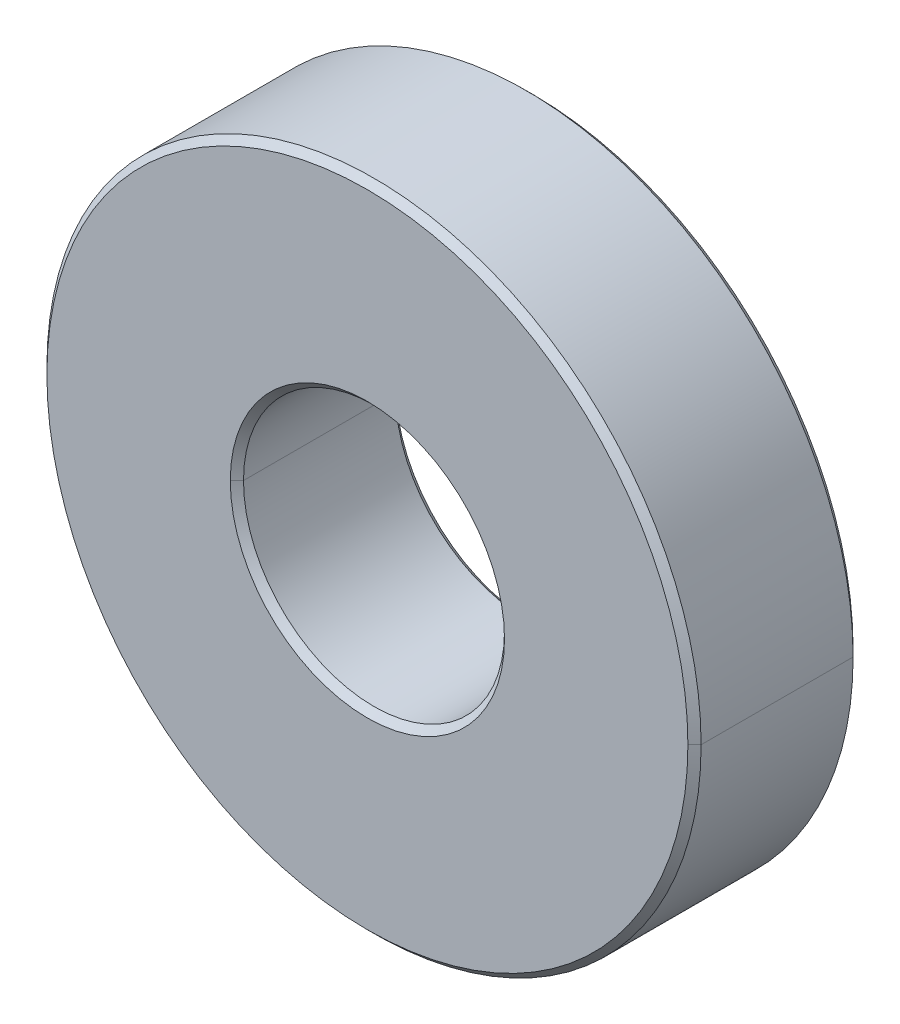
ISO-10303-21;
HEADER;
FILE_DESCRIPTION(('STEP AP214'),'2;1');
FILE_NAME('part.step','',(''),(''),'','','');
FILE_SCHEMA(('AUTOMOTIVE_DESIGN { 1 0 10303 214 1 1 1 1 }'));
ENDSEC;
DATA;
#1=APPLICATION_CONTEXT('core data for automotive mechanical design processes');
#2=APPLICATION_PROTOCOL_DEFINITION('international standard','automotive_design',2000,#1);
#3=PRODUCT_CONTEXT('',#1,'mechanical');
#4=PRODUCT('Part','Part','',(#3));
#5=PRODUCT_RELATED_PRODUCT_CATEGORY('part','',(#4));
#6=PRODUCT_DEFINITION_FORMATION('','',#4);
#7=PRODUCT_DEFINITION_CONTEXT('part definition',#1,'design');
#8=PRODUCT_DEFINITION('design','',#6,#7);
#9=PRODUCT_DEFINITION_SHAPE('','',#8);
#10=(LENGTH_UNIT() NAMED_UNIT(*) SI_UNIT(.MILLI.,.METRE.));
#11=(NAMED_UNIT(*) PLANE_ANGLE_UNIT() SI_UNIT($,.RADIAN.));
#12=(NAMED_UNIT(*) SI_UNIT($,.STERADIAN.) SOLID_ANGLE_UNIT());
#13=UNCERTAINTY_MEASURE_WITH_UNIT(LENGTH_MEASURE(1.E-05),#10,'distance_accuracy_value','');
#14=(GEOMETRIC_REPRESENTATION_CONTEXT(3) GLOBAL_UNCERTAINTY_ASSIGNED_CONTEXT((#13)) GLOBAL_UNIT_ASSIGNED_CONTEXT((#10,
#11,#12)) REPRESENTATION_CONTEXT('',''));
#15=CARTESIAN_POINT('',(0.,0.,0.));
#16=DIRECTION('',(0.,0.,1.));
#17=DIRECTION('',(1.,0.,0.));
#18=AXIS2_PLACEMENT_3D('',#15,#16,#17);
#19=CARTESIAN_POINT('',(0.,0.,2.5));
#20=DIRECTION('',(0.,0.,1.));
#21=DIRECTION('',(0.,-1.,0.));
#22=AXIS2_PLACEMENT_3D('',#19,#20,#21);
#23=PLANE('',#22);
#24=CARTESIAN_POINT('',(0.,0.,2.5));
#25=DIRECTION('',(0.,0.,1.));
#26=DIRECTION('',(1.,0.,0.));
#27=AXIS2_PLACEMENT_3D('',#24,#25,#26);
#28=CIRCLE('',#27,2.075);
#29=CARTESIAN_POINT('',(2.075,0.,2.5));
#30=VERTEX_POINT('',#29);
#31=CARTESIAN_POINT('',(-2.075,0.,2.5));
#32=VERTEX_POINT('',#31);
#33=EDGE_CURVE('E148',#30,#32,#28,.T.);
#34=ORIENTED_EDGE('',*,*,#33,.F.);
#35=CARTESIAN_POINT('',(0.,0.,2.5));
#36=DIRECTION('',(0.,0.,1.));
#37=DIRECTION('',(1.,0.,0.));
#38=AXIS2_PLACEMENT_3D('',#35,#36,#37);
#39=CIRCLE('',#38,2.075);
#40=EDGE_CURVE('E187',#32,#30,#39,.T.);
#41=ORIENTED_EDGE('',*,*,#40,.F.);
#42=EDGE_LOOP('',(#34,#41));
#43=FACE_BOUND('',#42,.T.);
#44=CARTESIAN_POINT('',(0.,0.,2.5));
#45=DIRECTION('',(0.,0.,1.));
#46=DIRECTION('',(1.,0.,0.));
#47=AXIS2_PLACEMENT_3D('',#44,#45,#46);
#48=CIRCLE('',#47,4.85);
#49=CARTESIAN_POINT('',(-4.85,0.,2.5));
#50=VERTEX_POINT('',#49);
#51=CARTESIAN_POINT('',(4.85,0.,2.5));
#52=VERTEX_POINT('',#51);
#53=EDGE_CURVE('E28',#50,#52,#48,.T.);
#54=ORIENTED_EDGE('',*,*,#53,.T.);
#55=CARTESIAN_POINT('',(0.,0.,2.5));
#56=DIRECTION('',(0.,0.,1.));
#57=DIRECTION('',(1.,0.,0.));
#58=AXIS2_PLACEMENT_3D('',#55,#56,#57);
#59=CIRCLE('',#58,4.85);
#60=EDGE_CURVE('E127',#52,#50,#59,.T.);
#61=ORIENTED_EDGE('',*,*,#60,.T.);
#62=EDGE_LOOP('',(#54,#61));
#63=FACE_BOUND('',#62,.T.);
#64=ADVANCED_FACE('F17',(#43,#63),#23,.T.);
#65=CARTESIAN_POINT('',(0.,0.,0.));
#66=DIRECTION('',(0.,0.,1.));
#67=DIRECTION('',(1.,0.,0.));
#68=AXIS2_PLACEMENT_3D('',#65,#66,#67);
#69=CYLINDRICAL_SURFACE('',#68,4.95);
#70=DIRECTION('',(0.,0.,1.));
#71=VECTOR('',#70,1.);
#72=CARTESIAN_POINT('',(-4.95,0.,0.));
#73=LINE('',#72,#71);
#74=CARTESIAN_POINT('',(-4.95,0.,0.1));
#75=VERTEX_POINT('',#74);
#76=CARTESIAN_POINT('',(-4.95,0.,2.4));
#77=VERTEX_POINT('',#76);
#78=EDGE_CURVE('E166',#75,#77,#73,.T.);
#79=ORIENTED_EDGE('',*,*,#78,.F.);
#80=CARTESIAN_POINT('',(0.,0.,0.1));
#81=DIRECTION('',(0.,0.,1.));
#82=DIRECTION('',(1.,0.,0.));
#83=AXIS2_PLACEMENT_3D('',#80,#81,#82);
#84=CIRCLE('',#83,4.95);
#85=CARTESIAN_POINT('',(4.95,0.,0.1));
#86=VERTEX_POINT('',#85);
#87=EDGE_CURVE('E123',#75,#86,#84,.T.);
#88=ORIENTED_EDGE('',*,*,#87,.T.);
#89=DIRECTION('',(0.,0.,1.));
#90=VECTOR('',#89,1.);
#91=CARTESIAN_POINT('',(4.95,0.,0.));
#92=LINE('',#91,#90);
#93=CARTESIAN_POINT('',(4.95,0.,2.4));
#94=VERTEX_POINT('',#93);
#95=EDGE_CURVE('E154',#86,#94,#92,.T.);
#96=ORIENTED_EDGE('',*,*,#95,.T.);
#97=CARTESIAN_POINT('',(0.,0.,2.4));
#98=DIRECTION('',(0.,0.,1.));
#99=DIRECTION('',(1.,0.,0.));
#100=AXIS2_PLACEMENT_3D('',#97,#98,#99);
#101=CIRCLE('',#100,4.95);
#102=EDGE_CURVE('E11',#77,#94,#101,.T.);
#103=ORIENTED_EDGE('',*,*,#102,.F.);
#104=EDGE_LOOP('',(#79,#88,#96,#103));
#105=FACE_BOUND('',#104,.T.);
#106=ADVANCED_FACE('F235',(#105),#69,.T.);
#107=CARTESIAN_POINT('',(0.,0.,0.));
#108=DIRECTION('',(0.,0.,-1.));
#109=DIRECTION('',(-1.,0.,0.));
#110=AXIS2_PLACEMENT_3D('',#107,#108,#109);
#111=PLANE('',#110);
#112=CARTESIAN_POINT('',(0.,0.,0.));
#113=DIRECTION('',(0.,0.,1.));
#114=DIRECTION('',(1.,0.,0.));
#115=AXIS2_PLACEMENT_3D('',#112,#113,#114);
#116=CIRCLE('',#115,2.075);
#117=CARTESIAN_POINT('',(-2.075,0.,0.));
#118=VERTEX_POINT('',#117);
#119=CARTESIAN_POINT('',(2.075,0.,0.));
#120=VERTEX_POINT('',#119);
#121=EDGE_CURVE('E163',#118,#120,#116,.T.);
#122=ORIENTED_EDGE('',*,*,#121,.T.);
#123=CARTESIAN_POINT('',(0.,0.,0.));
#124=DIRECTION('',(0.,0.,1.));
#125=DIRECTION('',(1.,0.,0.));
#126=AXIS2_PLACEMENT_3D('',#123,#124,#125);
#127=CIRCLE('',#126,2.075);
#128=EDGE_CURVE('E41',#120,#118,#127,.T.);
#129=ORIENTED_EDGE('',*,*,#128,.T.);
#130=EDGE_LOOP('',(#122,#129));
#131=FACE_BOUND('',#130,.T.);
#132=CARTESIAN_POINT('',(0.,0.,0.));
#133=DIRECTION('',(0.,0.,1.));
#134=DIRECTION('',(1.,0.,0.));
#135=AXIS2_PLACEMENT_3D('',#132,#133,#134);
#136=CIRCLE('',#135,4.85);
#137=CARTESIAN_POINT('',(4.85,0.,0.));
#138=VERTEX_POINT('',#137);
#139=CARTESIAN_POINT('',(-4.85,0.,0.));
#140=VERTEX_POINT('',#139);
#141=EDGE_CURVE('E132',#138,#140,#136,.T.);
#142=ORIENTED_EDGE('',*,*,#141,.F.);
#143=CARTESIAN_POINT('',(0.,0.,0.));
#144=DIRECTION('',(0.,0.,1.));
#145=DIRECTION('',(1.,0.,0.));
#146=AXIS2_PLACEMENT_3D('',#143,#144,#145);
#147=CIRCLE('',#146,4.85);
#148=EDGE_CURVE('E151',#140,#138,#147,.T.);
#149=ORIENTED_EDGE('',*,*,#148,.F.);
#150=EDGE_LOOP('',(#142,#149));
#151=FACE_BOUND('',#150,.T.);
#152=ADVANCED_FACE('F226',(#131,#151),#111,.T.);
#153=CARTESIAN_POINT('',(0.,0.,2.5));
#154=DIRECTION('',(0.,0.,1.));
#155=DIRECTION('',(1.,0.,0.));
#156=AXIS2_PLACEMENT_3D('',#153,#154,#155);
#157=CYLINDRICAL_SURFACE('',#156,1.975);
#158=DIRECTION('',(0.,0.,1.));
#159=VECTOR('',#158,1.);
#160=CARTESIAN_POINT('',(-1.975,0.,2.5));
#161=LINE('',#160,#159);
#162=CARTESIAN_POINT('',(-1.975,0.,0.1));
#163=VERTEX_POINT('',#162);
#164=CARTESIAN_POINT('',(-1.975,0.,2.4));
#165=VERTEX_POINT('',#164);
#166=EDGE_CURVE('E192',#163,#165,#161,.T.);
#167=ORIENTED_EDGE('',*,*,#166,.F.);
#168=CARTESIAN_POINT('',(0.,0.,0.1));
#169=DIRECTION('',(0.,0.,1.));
#170=DIRECTION('',(1.,0.,0.));
#171=AXIS2_PLACEMENT_3D('',#168,#169,#170);
#172=CIRCLE('',#171,1.975);
#173=CARTESIAN_POINT('',(1.975,0.,0.1));
#174=VERTEX_POINT('',#173);
#175=EDGE_CURVE('E92',#174,#163,#172,.T.);
#176=ORIENTED_EDGE('',*,*,#175,.F.);
#177=DIRECTION('',(0.,0.,1.));
#178=VECTOR('',#177,1.);
#179=CARTESIAN_POINT('',(1.975,0.,2.5));
#180=LINE('',#179,#178);
#181=CARTESIAN_POINT('',(1.975,0.,2.4));
#182=VERTEX_POINT('',#181);
#183=EDGE_CURVE('E135',#174,#182,#180,.T.);
#184=ORIENTED_EDGE('',*,*,#183,.T.);
#185=CARTESIAN_POINT('',(0.,0.,2.4));
#186=DIRECTION('',(0.,0.,1.));
#187=DIRECTION('',(1.,0.,0.));
#188=AXIS2_PLACEMENT_3D('',#185,#186,#187);
#189=CIRCLE('',#188,1.975);
#190=EDGE_CURVE('E82',#182,#165,#189,.T.);
#191=ORIENTED_EDGE('',*,*,#190,.T.);
#192=EDGE_LOOP('',(#167,#176,#184,#191));
#193=FACE_BOUND('',#192,.T.);
#194=ADVANCED_FACE('F224',(#193),#157,.F.);
#195=CARTESIAN_POINT('',(0.,0.,2.45));
#196=DIRECTION('',(0.,0.,-1.));
#197=DIRECTION('',(-1.,0.,0.));
#198=AXIS2_PLACEMENT_3D('',#195,#196,#197);
#199=CONICAL_SURFACE('',#198,4.9,0.785398163397446);
#200=DIRECTION('',(0.707106781186546,0.,-0.707106781186549));
#201=VECTOR('',#200,1.);
#202=CARTESIAN_POINT('',(4.9,0.,2.45));
#203=LINE('',#202,#201);
#204=EDGE_CURVE('E118',#52,#94,#203,.T.);
#205=ORIENTED_EDGE('',*,*,#204,.F.);
#206=ORIENTED_EDGE('',*,*,#53,.F.);
#207=DIRECTION('',(-0.707106781186546,0.,-0.707106781186549));
#208=VECTOR('',#207,1.);
#209=CARTESIAN_POINT('',(-4.9,0.,2.45));
#210=LINE('',#209,#208);
#211=EDGE_CURVE('E115',#50,#77,#210,.T.);
#212=ORIENTED_EDGE('',*,*,#211,.T.);
#213=ORIENTED_EDGE('',*,*,#102,.T.);
#214=EDGE_LOOP('',(#205,#206,#212,#213));
#215=FACE_BOUND('',#214,.T.);
#216=ADVANCED_FACE('F114',(#215),#199,.T.);
#217=CARTESIAN_POINT('',(0.,0.,0.05));
#218=DIRECTION('',(0.,0.,1.));
#219=DIRECTION('',(1.,0.,0.));
#220=AXIS2_PLACEMENT_3D('',#217,#218,#219);
#221=CONICAL_SURFACE('',#220,4.9,0.785398163397447);
#222=DIRECTION('',(-0.707106781186547,0.,0.707106781186549));
#223=VECTOR('',#222,1.);
#224=CARTESIAN_POINT('',(-4.9,0.,0.05));
#225=LINE('',#224,#223);
#226=EDGE_CURVE('E199',#140,#75,#225,.T.);
#227=ORIENTED_EDGE('',*,*,#226,.F.);
#228=ORIENTED_EDGE('',*,*,#148,.T.);
#229=DIRECTION('',(0.707106781186547,0.,0.707106781186549));
#230=VECTOR('',#229,1.);
#231=CARTESIAN_POINT('',(4.9,0.,0.05));
#232=LINE('',#231,#230);
#233=EDGE_CURVE('E194',#138,#86,#232,.T.);
#234=ORIENTED_EDGE('',*,*,#233,.T.);
#235=ORIENTED_EDGE('',*,*,#87,.F.);
#236=EDGE_LOOP('',(#227,#228,#234,#235));
#237=FACE_BOUND('',#236,.T.);
#238=ADVANCED_FACE('F233',(#237),#221,.T.);
#239=CARTESIAN_POINT('',(0.,0.,2.45));
#240=DIRECTION('',(0.,0.,1.));
#241=DIRECTION('',(1.,0.,0.));
#242=AXIS2_PLACEMENT_3D('',#239,#240,#241);
#243=CONICAL_SURFACE('',#242,2.025,0.785398163397448);
#244=DIRECTION('',(-0.707106781186547,0.,0.707106781186548));
#245=VECTOR('',#244,1.);
#246=CARTESIAN_POINT('',(-2.025,0.,2.45));
#247=LINE('',#246,#245);
#248=EDGE_CURVE('E198',#165,#32,#247,.T.);
#249=ORIENTED_EDGE('',*,*,#248,.F.);
#250=ORIENTED_EDGE('',*,*,#190,.F.);
#251=DIRECTION('',(0.707106781186547,0.,0.707106781186548));
#252=VECTOR('',#251,1.);
#253=CARTESIAN_POINT('',(2.025,0.,2.45));
#254=LINE('',#253,#252);
#255=EDGE_CURVE('E164',#182,#30,#254,.T.);
#256=ORIENTED_EDGE('',*,*,#255,.T.);
#257=ORIENTED_EDGE('',*,*,#33,.T.);
#258=EDGE_LOOP('',(#249,#250,#256,#257));
#259=FACE_BOUND('',#258,.T.);
#260=ADVANCED_FACE('F249',(#259),#243,.F.);
#261=CARTESIAN_POINT('',(0.,0.,0.05));
#262=DIRECTION('',(0.,0.,-1.));
#263=DIRECTION('',(-1.,0.,0.));
#264=AXIS2_PLACEMENT_3D('',#261,#262,#263);
#265=CONICAL_SURFACE('',#264,2.025,0.785398163397447);
#266=DIRECTION('',(0.707106781186547,0.,-0.707106781186549));
#267=VECTOR('',#266,1.);
#268=CARTESIAN_POINT('',(2.025,0.,0.05));
#269=LINE('',#268,#267);
#270=EDGE_CURVE('E159',#174,#120,#269,.T.);
#271=ORIENTED_EDGE('',*,*,#270,.F.);
#272=ORIENTED_EDGE('',*,*,#175,.T.);
#273=DIRECTION('',(-0.707106781186547,0.,-0.707106781186549));
#274=VECTOR('',#273,1.);
#275=CARTESIAN_POINT('',(-2.025,0.,0.05));
#276=LINE('',#275,#274);
#277=EDGE_CURVE('E21',#163,#118,#276,.T.);
#278=ORIENTED_EDGE('',*,*,#277,.T.);
#279=ORIENTED_EDGE('',*,*,#128,.F.);
#280=EDGE_LOOP('',(#271,#272,#278,#279));
#281=FACE_BOUND('',#280,.T.);
#282=ADVANCED_FACE('F259',(#281),#265,.F.);
#283=CARTESIAN_POINT('',(0.,0.,0.05));
#284=DIRECTION('',(0.,0.,-1.));
#285=DIRECTION('',(-1.,0.,0.));
#286=AXIS2_PLACEMENT_3D('',#283,#284,#285);
#287=CONICAL_SURFACE('',#286,2.025,0.785398163397447);
#288=CARTESIAN_POINT('',(0.,0.,0.1));
#289=DIRECTION('',(0.,0.,1.));
#290=DIRECTION('',(1.,0.,0.));
#291=AXIS2_PLACEMENT_3D('',#288,#289,#290);
#292=CIRCLE('',#291,1.975);
#293=EDGE_CURVE('E158',#163,#174,#292,.T.);
#294=ORIENTED_EDGE('',*,*,#293,.T.);
#295=ORIENTED_EDGE('',*,*,#270,.T.);
#296=ORIENTED_EDGE('',*,*,#121,.F.);
#297=ORIENTED_EDGE('',*,*,#277,.F.);
#298=EDGE_LOOP('',(#294,#295,#296,#297));
#299=FACE_BOUND('',#298,.T.);
#300=ADVANCED_FACE('F255',(#299),#287,.F.);
#301=CARTESIAN_POINT('',(0.,0.,2.45));
#302=DIRECTION('',(0.,0.,1.));
#303=DIRECTION('',(1.,0.,0.));
#304=AXIS2_PLACEMENT_3D('',#301,#302,#303);
#305=CONICAL_SURFACE('',#304,2.025,0.785398163397448);
#306=CARTESIAN_POINT('',(0.,0.,2.4));
#307=DIRECTION('',(0.,0.,1.));
#308=DIRECTION('',(1.,0.,0.));
#309=AXIS2_PLACEMENT_3D('',#306,#307,#308);
#310=CIRCLE('',#309,1.975);
#311=EDGE_CURVE('E143',#165,#182,#310,.T.);
#312=ORIENTED_EDGE('',*,*,#311,.F.);
#313=ORIENTED_EDGE('',*,*,#248,.T.);
#314=ORIENTED_EDGE('',*,*,#40,.T.);
#315=ORIENTED_EDGE('',*,*,#255,.F.);
#316=EDGE_LOOP('',(#312,#313,#314,#315));
#317=FACE_BOUND('',#316,.T.);
#318=ADVANCED_FACE('F251',(#317),#305,.F.);
#319=CARTESIAN_POINT('',(0.,0.,0.05));
#320=DIRECTION('',(0.,0.,1.));
#321=DIRECTION('',(1.,0.,0.));
#322=AXIS2_PLACEMENT_3D('',#319,#320,#321);
#323=CONICAL_SURFACE('',#322,4.9,0.785398163397447);
#324=ORIENTED_EDGE('',*,*,#141,.T.);
#325=ORIENTED_EDGE('',*,*,#226,.T.);
#326=CARTESIAN_POINT('',(0.,0.,0.1));
#327=DIRECTION('',(0.,0.,1.));
#328=DIRECTION('',(1.,0.,0.));
#329=AXIS2_PLACEMENT_3D('',#326,#327,#328);
#330=CIRCLE('',#329,4.95);
#331=EDGE_CURVE('E168',#86,#75,#330,.T.);
#332=ORIENTED_EDGE('',*,*,#331,.F.);
#333=ORIENTED_EDGE('',*,*,#233,.F.);
#334=EDGE_LOOP('',(#324,#325,#332,#333));
#335=FACE_BOUND('',#334,.T.);
#336=ADVANCED_FACE('F254',(#335),#323,.T.);
#337=CARTESIAN_POINT('',(0.,0.,2.45));
#338=DIRECTION('',(0.,0.,-1.));
#339=DIRECTION('',(-1.,0.,0.));
#340=AXIS2_PLACEMENT_3D('',#337,#338,#339);
#341=CONICAL_SURFACE('',#340,4.9,0.785398163397446);
#342=ORIENTED_EDGE('',*,*,#60,.F.);
#343=ORIENTED_EDGE('',*,*,#204,.T.);
#344=CARTESIAN_POINT('',(0.,0.,2.4));
#345=DIRECTION('',(0.,0.,1.));
#346=DIRECTION('',(1.,0.,0.));
#347=AXIS2_PLACEMENT_3D('',#344,#345,#346);
#348=CIRCLE('',#347,4.95);
#349=EDGE_CURVE('E129',#94,#77,#348,.T.);
#350=ORIENTED_EDGE('',*,*,#349,.T.);
#351=ORIENTED_EDGE('',*,*,#211,.F.);
#352=EDGE_LOOP('',(#342,#343,#350,#351));
#353=FACE_BOUND('',#352,.T.);
#354=ADVANCED_FACE('F126',(#353),#341,.T.);
#355=CARTESIAN_POINT('',(0.,0.,2.5));
#356=DIRECTION('',(0.,0.,1.));
#357=DIRECTION('',(1.,0.,0.));
#358=AXIS2_PLACEMENT_3D('',#355,#356,#357);
#359=CYLINDRICAL_SURFACE('',#358,1.975);
#360=ORIENTED_EDGE('',*,*,#293,.F.);
#361=ORIENTED_EDGE('',*,*,#166,.T.);
#362=ORIENTED_EDGE('',*,*,#311,.T.);
#363=ORIENTED_EDGE('',*,*,#183,.F.);
#364=EDGE_LOOP('',(#360,#361,#362,#363));
#365=FACE_BOUND('',#364,.T.);
#366=ADVANCED_FACE('F221',(#365),#359,.F.);
#367=CARTESIAN_POINT('',(0.,0.,0.));
#368=DIRECTION('',(0.,0.,1.));
#369=DIRECTION('',(1.,0.,0.));
#370=AXIS2_PLACEMENT_3D('',#367,#368,#369);
#371=CYLINDRICAL_SURFACE('',#370,4.95);
#372=ORIENTED_EDGE('',*,*,#331,.T.);
#373=ORIENTED_EDGE('',*,*,#78,.T.);
#374=ORIENTED_EDGE('',*,*,#349,.F.);
#375=ORIENTED_EDGE('',*,*,#95,.F.);
#376=EDGE_LOOP('',(#372,#373,#374,#375));
#377=FACE_BOUND('',#376,.T.);
#378=ADVANCED_FACE('F19',(#377),#371,.T.);
#379=CLOSED_SHELL('',(#64,#106,#152,#194,#216,#238,#260,#282,#300,#318,#336,#354,#366,#378));
#380=MANIFOLD_SOLID_BREP('B1',#379);
#381=ADVANCED_BREP_SHAPE_REPRESENTATION('',(#18,#380),#14);
#382=SHAPE_DEFINITION_REPRESENTATION(#9,#381);
ENDSEC;
END-ISO-10303-21;
